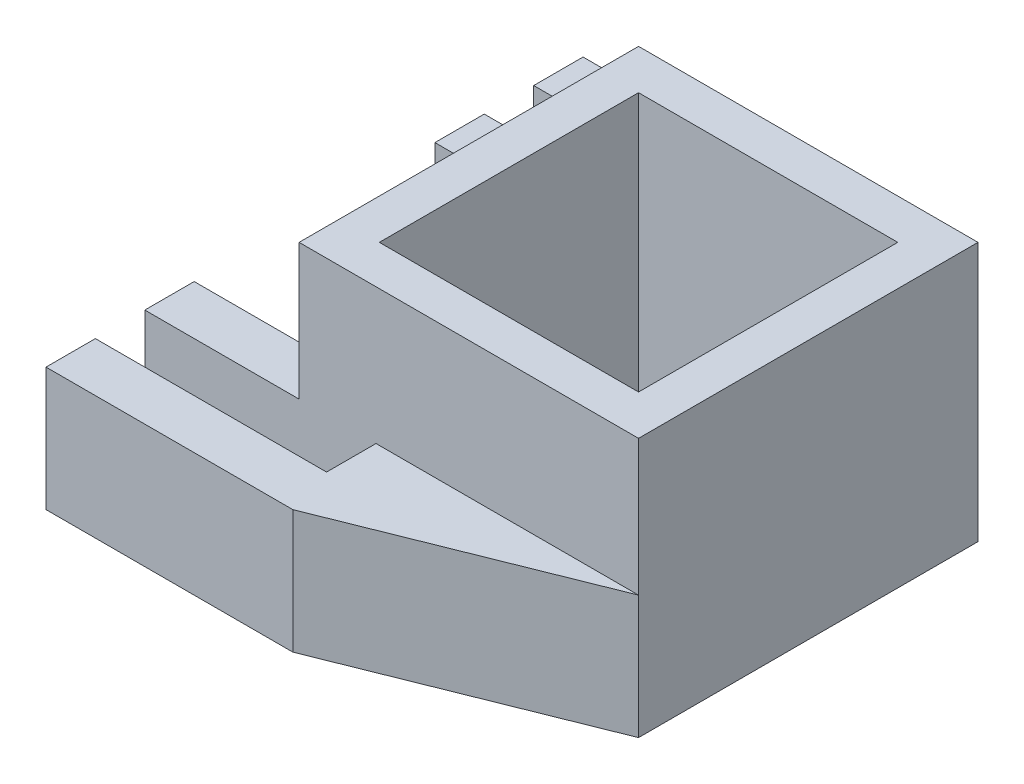
ISO-10303-21;
HEADER;
FILE_DESCRIPTION(('STEP AP214'),'2;1');
FILE_NAME('part.step','',(''),(''),'','','');
FILE_SCHEMA(('AUTOMOTIVE_DESIGN { 1 0 10303 214 1 1 1 1 }'));
ENDSEC;
DATA;
#1=APPLICATION_CONTEXT('core data for automotive mechanical design processes');
#2=APPLICATION_PROTOCOL_DEFINITION('international standard','automotive_design',2000,#1);
#3=PRODUCT_CONTEXT('',#1,'mechanical');
#4=PRODUCT('Part','Part','',(#3));
#5=PRODUCT_RELATED_PRODUCT_CATEGORY('part','',(#4));
#6=PRODUCT_DEFINITION_FORMATION('','',#4);
#7=PRODUCT_DEFINITION_CONTEXT('part definition',#1,'design');
#8=PRODUCT_DEFINITION('design','',#6,#7);
#9=PRODUCT_DEFINITION_SHAPE('','',#8);
#10=(LENGTH_UNIT() NAMED_UNIT(*) SI_UNIT(.MILLI.,.METRE.));
#11=(NAMED_UNIT(*) PLANE_ANGLE_UNIT() SI_UNIT($,.RADIAN.));
#12=(NAMED_UNIT(*) SI_UNIT($,.STERADIAN.) SOLID_ANGLE_UNIT());
#13=UNCERTAINTY_MEASURE_WITH_UNIT(LENGTH_MEASURE(1.E-05),#10,'distance_accuracy_value','');
#14=(GEOMETRIC_REPRESENTATION_CONTEXT(3) GLOBAL_UNCERTAINTY_ASSIGNED_CONTEXT((#13)) GLOBAL_UNIT_ASSIGNED_CONTEXT((#10,
#11,#12)) REPRESENTATION_CONTEXT('',''));
#15=CARTESIAN_POINT('',(0.,0.,0.));
#16=DIRECTION('',(0.,0.,1.));
#17=DIRECTION('',(1.,0.,0.));
#18=AXIS2_PLACEMENT_3D('',#15,#16,#17);
#19=CARTESIAN_POINT('',(-6.5,42.,6.5));
#20=DIRECTION('',(0.,0.,-1.));
#21=DIRECTION('',(-1.,0.,0.));
#22=AXIS2_PLACEMENT_3D('',#19,#20,#21);
#23=PLANE('',#22);
#24=DIRECTION('',(0.,-1.,0.));
#25=VECTOR('',#24,1.);
#26=CARTESIAN_POINT('',(5.96,20.,6.5));
#27=LINE('',#26,#25);
#28=CARTESIAN_POINT('',(5.96,20.,6.5));
#29=VERTEX_POINT('',#28);
#30=CARTESIAN_POINT('',(5.96,0.,6.5));
#31=VERTEX_POINT('',#30);
#32=EDGE_CURVE('E333',#29,#31,#27,.T.);
#33=ORIENTED_EDGE('',*,*,#32,.F.);
#34=DIRECTION('',(1.,0.,0.));
#35=VECTOR('',#34,1.);
#36=CARTESIAN_POINT('',(48.5,20.,6.5));
#37=LINE('',#36,#35);
#38=CARTESIAN_POINT('',(48.5,20.,6.5));
#39=VERTEX_POINT('',#38);
#40=EDGE_CURVE('E300',#29,#39,#37,.T.);
#41=ORIENTED_EDGE('',*,*,#40,.T.);
#42=DIRECTION('',(0.,-1.,0.));
#43=VECTOR('',#42,1.);
#44=CARTESIAN_POINT('',(48.5,42.,6.5));
#45=LINE('',#44,#43);
#46=CARTESIAN_POINT('',(48.5,42.,6.5));
#47=VERTEX_POINT('',#46);
#48=EDGE_CURVE('E41',#47,#39,#45,.T.);
#49=ORIENTED_EDGE('',*,*,#48,.F.);
#50=DIRECTION('',(1.,0.,0.));
#51=VECTOR('',#50,1.);
#52=CARTESIAN_POINT('',(-6.5,42.,6.5));
#53=LINE('',#52,#51);
#54=CARTESIAN_POINT('',(-6.5,42.,6.5));
#55=VERTEX_POINT('',#54);
#56=EDGE_CURVE('E380',#55,#47,#53,.T.);
#57=ORIENTED_EDGE('',*,*,#56,.F.);
#58=DIRECTION('',(0.,-1.,0.));
#59=VECTOR('',#58,1.);
#60=CARTESIAN_POINT('',(-6.5,42.,6.5));
#61=LINE('',#60,#59);
#62=CARTESIAN_POINT('',(-6.5,20.,6.5));
#63=VERTEX_POINT('',#62);
#64=EDGE_CURVE('E11',#55,#63,#61,.T.);
#65=ORIENTED_EDGE('',*,*,#64,.T.);
#66=DIRECTION('',(-1.,0.,0.));
#67=VECTOR('',#66,1.);
#68=CARTESIAN_POINT('',(-6.5,20.,6.5));
#69=LINE('',#68,#67);
#70=CARTESIAN_POINT('',(-31.5,20.,6.5));
#71=VERTEX_POINT('',#70);
#72=EDGE_CURVE('E231',#63,#71,#69,.T.);
#73=ORIENTED_EDGE('',*,*,#72,.T.);
#74=DIRECTION('',(0.,-1.,0.));
#75=VECTOR('',#74,1.);
#76=CARTESIAN_POINT('',(-31.5,20.,6.5));
#77=LINE('',#76,#75);
#78=CARTESIAN_POINT('',(-31.5,0.,6.5));
#79=VERTEX_POINT('',#78);
#80=EDGE_CURVE('E241',#71,#79,#77,.T.);
#81=ORIENTED_EDGE('',*,*,#80,.T.);
#82=DIRECTION('',(1.,0.,0.));
#83=VECTOR('',#82,1.);
#84=CARTESIAN_POINT('',(-6.5,0.,6.5));
#85=LINE('',#84,#83);
#86=EDGE_CURVE('E389',#79,#31,#85,.T.);
#87=ORIENTED_EDGE('',*,*,#86,.T.);
#88=EDGE_LOOP('',(#33,#41,#49,#57,#65,#73,#81,#87));
#89=FACE_BOUND('',#88,.T.);
#90=ADVANCED_FACE('F33',(#89),#23,.F.);
#91=CARTESIAN_POINT('',(0.,42.,0.));
#92=DIRECTION('',(0.,-1.,0.));
#93=DIRECTION('',(0.,0.,-1.));
#94=AXIS2_PLACEMENT_3D('',#91,#92,#93);
#95=PLANE('',#94);
#96=DIRECTION('',(0.,0.,1.));
#97=VECTOR('',#96,1.);
#98=CARTESIAN_POINT('',(-6.5,42.,6.5));
#99=LINE('',#98,#97);
#100=CARTESIAN_POINT('',(-6.5,42.,-48.5));
#101=VERTEX_POINT('',#100);
#102=EDGE_CURVE('E377',#101,#55,#99,.T.);
#103=ORIENTED_EDGE('',*,*,#102,.T.);
#104=ORIENTED_EDGE('',*,*,#56,.T.);
#105=DIRECTION('',(0.,0.,-1.));
#106=VECTOR('',#105,1.);
#107=CARTESIAN_POINT('',(48.5,42.,6.5));
#108=LINE('',#107,#106);
#109=CARTESIAN_POINT('',(48.5,42.,-48.5));
#110=VERTEX_POINT('',#109);
#111=EDGE_CURVE('E383',#47,#110,#108,.T.);
#112=ORIENTED_EDGE('',*,*,#111,.T.);
#113=DIRECTION('',(-1.,0.,0.));
#114=VECTOR('',#113,1.);
#115=CARTESIAN_POINT('',(-6.5,42.,-48.5));
#116=LINE('',#115,#114);
#117=EDGE_CURVE('E385',#110,#101,#116,.T.);
#118=ORIENTED_EDGE('',*,*,#117,.T.);
#119=EDGE_LOOP('',(#103,#104,#112,#118));
#120=FACE_BOUND('',#119,.T.);
#121=DIRECTION('',(0.,0.,1.));
#122=VECTOR('',#121,1.);
#123=CARTESIAN_POINT('',(0.,42.,0.));
#124=LINE('',#123,#122);
#125=CARTESIAN_POINT('',(0.,42.,-42.));
#126=VERTEX_POINT('',#125);
#127=CARTESIAN_POINT('',(0.,42.,0.));
#128=VERTEX_POINT('',#127);
#129=EDGE_CURVE('E346',#126,#128,#124,.T.);
#130=ORIENTED_EDGE('',*,*,#129,.F.);
#131=DIRECTION('',(-1.,0.,0.));
#132=VECTOR('',#131,1.);
#133=CARTESIAN_POINT('',(0.,42.,-42.));
#134=LINE('',#133,#132);
#135=CARTESIAN_POINT('',(42.,42.,-42.));
#136=VERTEX_POINT('',#135);
#137=EDGE_CURVE('E354',#136,#126,#134,.T.);
#138=ORIENTED_EDGE('',*,*,#137,.F.);
#139=DIRECTION('',(0.,0.,-1.));
#140=VECTOR('',#139,1.);
#141=CARTESIAN_POINT('',(42.,42.,0.));
#142=LINE('',#141,#140);
#143=CARTESIAN_POINT('',(42.,42.,0.));
#144=VERTEX_POINT('',#143);
#145=EDGE_CURVE('E351',#144,#136,#142,.T.);
#146=ORIENTED_EDGE('',*,*,#145,.F.);
#147=DIRECTION('',(1.,0.,0.));
#148=VECTOR('',#147,1.);
#149=CARTESIAN_POINT('',(0.,42.,0.));
#150=LINE('',#149,#148);
#151=EDGE_CURVE('E348',#128,#144,#150,.T.);
#152=ORIENTED_EDGE('',*,*,#151,.F.);
#153=EDGE_LOOP('',(#130,#138,#146,#152));
#154=FACE_BOUND('',#153,.T.);
#155=ADVANCED_FACE('F441',(#120,#154),#95,.F.);
#156=CARTESIAN_POINT('',(0.,0.,0.));
#157=DIRECTION('',(0.,-1.,0.));
#158=DIRECTION('',(0.,0.,-1.));
#159=AXIS2_PLACEMENT_3D('',#156,#157,#158);
#160=PLANE('',#159);
#161=DIRECTION('',(0.,0.,1.));
#162=VECTOR('',#161,1.);
#163=CARTESIAN_POINT('',(-6.5,0.,6.5));
#164=LINE('',#163,#162);
#165=CARTESIAN_POINT('',(-6.5,0.,-40.5));
#166=VERTEX_POINT('',#165);
#167=CARTESIAN_POINT('',(-6.5,0.,-1.50000000000001));
#168=VERTEX_POINT('',#167);
#169=EDGE_CURVE('E376',#166,#168,#164,.T.);
#170=ORIENTED_EDGE('',*,*,#169,.F.);
#171=DIRECTION('',(-1.,0.,0.));
#172=VECTOR('',#171,1.);
#173=CARTESIAN_POINT('',(-6.5,0.,-40.5));
#174=LINE('',#173,#172);
#175=CARTESIAN_POINT('',(-31.5,0.,-40.5));
#176=VERTEX_POINT('',#175);
#177=EDGE_CURVE('E224',#166,#176,#174,.T.);
#178=ORIENTED_EDGE('',*,*,#177,.T.);
#179=DIRECTION('',(0.,0.,-1.));
#180=VECTOR('',#179,1.);
#181=CARTESIAN_POINT('',(-31.5,0.,-48.5));
#182=LINE('',#181,#180);
#183=CARTESIAN_POINT('',(-31.5,0.,-48.5));
#184=VERTEX_POINT('',#183);
#185=EDGE_CURVE('E205',#176,#184,#182,.T.);
#186=ORIENTED_EDGE('',*,*,#185,.T.);
#187=DIRECTION('',(-1.,0.,0.));
#188=VECTOR('',#187,1.);
#189=CARTESIAN_POINT('',(-6.5,0.,-48.5));
#190=LINE('',#189,#188);
#191=CARTESIAN_POINT('',(5.96,0.,-48.5));
#192=VERTEX_POINT('',#191);
#193=EDGE_CURVE('E381',#192,#184,#190,.T.);
#194=ORIENTED_EDGE('',*,*,#193,.F.);
#195=DIRECTION('',(0.,0.,-1.));
#196=VECTOR('',#195,1.);
#197=CARTESIAN_POINT('',(5.96,0.,-48.5));
#198=LINE('',#197,#196);
#199=CARTESIAN_POINT('',(5.96,0.,-56.51));
#200=VERTEX_POINT('',#199);
#201=EDGE_CURVE('E276',#192,#200,#198,.T.);
#202=ORIENTED_EDGE('',*,*,#201,.T.);
#203=DIRECTION('',(-1.,0.,0.));
#204=VECTOR('',#203,1.);
#205=CARTESIAN_POINT('',(5.96,0.,-56.51));
#206=LINE('',#205,#204);
#207=CARTESIAN_POINT('',(-31.5,0.,-56.51));
#208=VERTEX_POINT('',#207);
#209=EDGE_CURVE('E279',#200,#208,#206,.T.);
#210=ORIENTED_EDGE('',*,*,#209,.T.);
#211=DIRECTION('',(0.,0.,-1.));
#212=VECTOR('',#211,1.);
#213=CARTESIAN_POINT('',(-31.5,0.,-56.51));
#214=LINE('',#213,#212);
#215=CARTESIAN_POINT('',(-31.5,0.,-64.51));
#216=VERTEX_POINT('',#215);
#217=EDGE_CURVE('E282',#208,#216,#214,.T.);
#218=ORIENTED_EDGE('',*,*,#217,.T.);
#219=DIRECTION('',(1.,0.,0.));
#220=VECTOR('',#219,1.);
#221=CARTESIAN_POINT('',(-31.5,0.,-64.51));
#222=LINE('',#221,#220);
#223=CARTESIAN_POINT('',(8.5,0.,-64.51));
#224=VERTEX_POINT('',#223);
#225=EDGE_CURVE('E258',#216,#224,#222,.T.);
#226=ORIENTED_EDGE('',*,*,#225,.T.);
#227=DIRECTION('',(0.928396635133499,0.,0.371590753212182));
#228=VECTOR('',#227,1.);
#229=CARTESIAN_POINT('',(8.5,0.,-64.51));
#230=LINE('',#229,#228);
#231=CARTESIAN_POINT('',(48.5,0.,-48.5));
#232=VERTEX_POINT('',#231);
#233=EDGE_CURVE('E249',#224,#232,#230,.T.);
#234=ORIENTED_EDGE('',*,*,#233,.T.);
#235=DIRECTION('',(0.,0.,-1.));
#236=VECTOR('',#235,1.);
#237=CARTESIAN_POINT('',(48.5,0.,6.5));
#238=LINE('',#237,#236);
#239=CARTESIAN_POINT('',(48.5,0.,6.5));
#240=VERTEX_POINT('',#239);
#241=EDGE_CURVE('E392',#240,#232,#238,.T.);
#242=ORIENTED_EDGE('',*,*,#241,.F.);
#243=DIRECTION('',(-0.928396635133499,0.,0.371590753212183));
#244=VECTOR('',#243,1.);
#245=CARTESIAN_POINT('',(8.5,0.,22.51));
#246=LINE('',#245,#244);
#247=CARTESIAN_POINT('',(8.5,0.,22.51));
#248=VERTEX_POINT('',#247);
#249=EDGE_CURVE('E289',#240,#248,#246,.T.);
#250=ORIENTED_EDGE('',*,*,#249,.T.);
#251=DIRECTION('',(-1.,0.,0.));
#252=VECTOR('',#251,1.);
#253=CARTESIAN_POINT('',(-31.5,0.,22.51));
#254=LINE('',#253,#252);
#255=CARTESIAN_POINT('',(-31.5,0.,22.51));
#256=VERTEX_POINT('',#255);
#257=EDGE_CURVE('E322',#248,#256,#254,.T.);
#258=ORIENTED_EDGE('',*,*,#257,.T.);
#259=DIRECTION('',(0.,0.,-1.));
#260=VECTOR('',#259,1.);
#261=CARTESIAN_POINT('',(-31.5,0.,14.51));
#262=LINE('',#261,#260);
#263=CARTESIAN_POINT('',(-31.5,0.,14.51));
#264=VERTEX_POINT('',#263);
#265=EDGE_CURVE('E325',#256,#264,#262,.T.);
#266=ORIENTED_EDGE('',*,*,#265,.T.);
#267=DIRECTION('',(1.,0.,0.));
#268=VECTOR('',#267,1.);
#269=CARTESIAN_POINT('',(5.96,0.,14.51));
#270=LINE('',#269,#268);
#271=CARTESIAN_POINT('',(5.96,0.,14.51));
#272=VERTEX_POINT('',#271);
#273=EDGE_CURVE('E328',#264,#272,#270,.T.);
#274=ORIENTED_EDGE('',*,*,#273,.T.);
#275=DIRECTION('',(0.,0.,-1.));
#276=VECTOR('',#275,1.);
#277=CARTESIAN_POINT('',(5.96,0.,6.5));
#278=LINE('',#277,#276);
#279=EDGE_CURVE('E304',#272,#31,#278,.T.);
#280=ORIENTED_EDGE('',*,*,#279,.T.);
#281=ORIENTED_EDGE('',*,*,#86,.F.);
#282=DIRECTION('',(0.,0.,-1.));
#283=VECTOR('',#282,1.);
#284=CARTESIAN_POINT('',(-31.5,0.,6.5));
#285=LINE('',#284,#283);
#286=CARTESIAN_POINT('',(-31.5,0.,-1.50000000000001));
#287=VERTEX_POINT('',#286);
#288=EDGE_CURVE('E227',#79,#287,#285,.T.);
#289=ORIENTED_EDGE('',*,*,#288,.T.);
#290=DIRECTION('',(1.,0.,0.));
#291=VECTOR('',#290,1.);
#292=CARTESIAN_POINT('',(-6.5,0.,-1.5));
#293=LINE('',#292,#291);
#294=EDGE_CURVE('E232',#287,#168,#293,.T.);
#295=ORIENTED_EDGE('',*,*,#294,.T.);
#296=EDGE_LOOP('',(#170,#178,#186,#194,#202,#210,#218,#226,#234,#242,#250,#258,#266,#274,#280,
#281,#289,#295));
#297=FACE_BOUND('',#296,.T.);
#298=DIRECTION('',(-1.,0.,0.));
#299=VECTOR('',#298,1.);
#300=CARTESIAN_POINT('',(0.,0.,-42.));
#301=LINE('',#300,#299);
#302=CARTESIAN_POINT('',(42.,0.,-42.));
#303=VERTEX_POINT('',#302);
#304=CARTESIAN_POINT('',(0.,0.,-42.));
#305=VERTEX_POINT('',#304);
#306=EDGE_CURVE('E349',#303,#305,#301,.T.);
#307=ORIENTED_EDGE('',*,*,#306,.T.);
#308=DIRECTION('',(0.,0.,1.));
#309=VECTOR('',#308,1.);
#310=CARTESIAN_POINT('',(0.,0.,0.));
#311=LINE('',#310,#309);
#312=CARTESIAN_POINT('',(0.,0.,0.));
#313=VERTEX_POINT('',#312);
#314=EDGE_CURVE('E335',#305,#313,#311,.T.);
#315=ORIENTED_EDGE('',*,*,#314,.T.);
#316=DIRECTION('',(1.,0.,0.));
#317=VECTOR('',#316,1.);
#318=CARTESIAN_POINT('',(0.,0.,0.));
#319=LINE('',#318,#317);
#320=CARTESIAN_POINT('',(42.,0.,0.));
#321=VERTEX_POINT('',#320);
#322=EDGE_CURVE('E359',#313,#321,#319,.T.);
#323=ORIENTED_EDGE('',*,*,#322,.T.);
#324=DIRECTION('',(0.,0.,-1.));
#325=VECTOR('',#324,1.);
#326=CARTESIAN_POINT('',(42.,0.,0.));
#327=LINE('',#326,#325);
#328=EDGE_CURVE('E362',#321,#303,#327,.T.);
#329=ORIENTED_EDGE('',*,*,#328,.T.);
#330=EDGE_LOOP('',(#307,#315,#323,#329));
#331=FACE_BOUND('',#330,.T.);
#332=ADVANCED_FACE('F430',(#297,#331),#160,.T.);
#333=CARTESIAN_POINT('',(-6.5,42.,6.5));
#334=DIRECTION('',(1.,0.,0.));
#335=DIRECTION('',(0.,0.,-1.));
#336=AXIS2_PLACEMENT_3D('',#333,#334,#335);
#337=PLANE('',#336);
#338=DIRECTION('',(0.,0.,1.));
#339=VECTOR('',#338,1.);
#340=CARTESIAN_POINT('',(-6.5,20.,-48.5));
#341=LINE('',#340,#339);
#342=CARTESIAN_POINT('',(-6.5,20.,-48.5));
#343=VERTEX_POINT('',#342);
#344=CARTESIAN_POINT('',(-6.5,20.,-40.5));
#345=VERTEX_POINT('',#344);
#346=EDGE_CURVE('E48',#343,#345,#341,.T.);
#347=ORIENTED_EDGE('',*,*,#346,.T.);
#348=DIRECTION('',(0.,-1.,0.));
#349=VECTOR('',#348,1.);
#350=CARTESIAN_POINT('',(-6.5,20.,-40.5));
#351=LINE('',#350,#349);
#352=EDGE_CURVE('E52',#345,#166,#351,.T.);
#353=ORIENTED_EDGE('',*,*,#352,.T.);
#354=ORIENTED_EDGE('',*,*,#169,.T.);
#355=DIRECTION('',(0.,-1.,0.));
#356=VECTOR('',#355,1.);
#357=CARTESIAN_POINT('',(-6.5,20.,-1.5));
#358=LINE('',#357,#356);
#359=CARTESIAN_POINT('',(-6.5,20.,-1.50000000000001));
#360=VERTEX_POINT('',#359);
#361=EDGE_CURVE('E246',#360,#168,#358,.T.);
#362=ORIENTED_EDGE('',*,*,#361,.F.);
#363=DIRECTION('',(0.,0.,1.));
#364=VECTOR('',#363,1.);
#365=CARTESIAN_POINT('',(-6.5,20.,6.5));
#366=LINE('',#365,#364);
#367=EDGE_CURVE('E229',#360,#63,#366,.T.);
#368=ORIENTED_EDGE('',*,*,#367,.T.);
#369=ORIENTED_EDGE('',*,*,#64,.F.);
#370=ORIENTED_EDGE('',*,*,#102,.F.);
#371=DIRECTION('',(0.,-1.,0.));
#372=VECTOR('',#371,1.);
#373=CARTESIAN_POINT('',(-6.5,42.,-48.5));
#374=LINE('',#373,#372);
#375=EDGE_CURVE('E387',#101,#343,#374,.T.);
#376=ORIENTED_EDGE('',*,*,#375,.T.);
#377=EDGE_LOOP('',(#347,#353,#354,#362,#368,#369,#370,#376));
#378=FACE_BOUND('',#377,.T.);
#379=ADVANCED_FACE('F35',(#378),#337,.F.);
#380=CARTESIAN_POINT('',(48.5,42.,6.5));
#381=DIRECTION('',(-1.,0.,0.));
#382=DIRECTION('',(0.,0.,1.));
#383=AXIS2_PLACEMENT_3D('',#380,#381,#382);
#384=PLANE('',#383);
#385=ORIENTED_EDGE('',*,*,#241,.T.);
#386=DIRECTION('',(0.,-1.,0.));
#387=VECTOR('',#386,1.);
#388=CARTESIAN_POINT('',(48.5,20.,-48.5));
#389=LINE('',#388,#387);
#390=CARTESIAN_POINT('',(48.5,20.,-48.5));
#391=VERTEX_POINT('',#390);
#392=EDGE_CURVE('E273',#391,#232,#389,.T.);
#393=ORIENTED_EDGE('',*,*,#392,.F.);
#394=DIRECTION('',(0.,-1.,0.));
#395=VECTOR('',#394,1.);
#396=CARTESIAN_POINT('',(48.5,42.,-48.5));
#397=LINE('',#396,#395);
#398=EDGE_CURVE('E397',#110,#391,#397,.T.);
#399=ORIENTED_EDGE('',*,*,#398,.F.);
#400=ORIENTED_EDGE('',*,*,#111,.F.);
#401=ORIENTED_EDGE('',*,*,#48,.T.);
#402=DIRECTION('',(0.,-1.,0.));
#403=VECTOR('',#402,1.);
#404=CARTESIAN_POINT('',(48.5,20.,6.5));
#405=LINE('',#404,#403);
#406=EDGE_CURVE('E319',#39,#240,#405,.T.);
#407=ORIENTED_EDGE('',*,*,#406,.T.);
#408=EDGE_LOOP('',(#385,#393,#399,#400,#401,#407));
#409=FACE_BOUND('',#408,.T.);
#410=ADVANCED_FACE('F403',(#409),#384,.F.);
#411=CARTESIAN_POINT('',(-6.5,42.,-48.5));
#412=DIRECTION('',(0.,0.,1.));
#413=DIRECTION('',(1.,0.,0.));
#414=AXIS2_PLACEMENT_3D('',#411,#412,#413);
#415=PLANE('',#414);
#416=ORIENTED_EDGE('',*,*,#398,.T.);
#417=DIRECTION('',(-1.,0.,0.));
#418=VECTOR('',#417,1.);
#419=CARTESIAN_POINT('',(48.5,20.,-48.5));
#420=LINE('',#419,#418);
#421=CARTESIAN_POINT('',(5.96,20.,-48.5));
#422=VERTEX_POINT('',#421);
#423=EDGE_CURVE('E257',#391,#422,#420,.T.);
#424=ORIENTED_EDGE('',*,*,#423,.T.);
#425=DIRECTION('',(0.,-1.,0.));
#426=VECTOR('',#425,1.);
#427=CARTESIAN_POINT('',(5.96,20.,-48.5));
#428=LINE('',#427,#426);
#429=EDGE_CURVE('E296',#422,#192,#428,.T.);
#430=ORIENTED_EDGE('',*,*,#429,.T.);
#431=ORIENTED_EDGE('',*,*,#193,.T.);
#432=DIRECTION('',(0.,-1.,0.));
#433=VECTOR('',#432,1.);
#434=CARTESIAN_POINT('',(-31.5,20.,-48.5));
#435=LINE('',#434,#433);
#436=CARTESIAN_POINT('',(-31.5,20.,-48.5));
#437=VERTEX_POINT('',#436);
#438=EDGE_CURVE('E209',#437,#184,#435,.T.);
#439=ORIENTED_EDGE('',*,*,#438,.F.);
#440=DIRECTION('',(1.,0.,0.));
#441=VECTOR('',#440,1.);
#442=CARTESIAN_POINT('',(-6.5,20.,-48.5));
#443=LINE('',#442,#441);
#444=EDGE_CURVE('E219',#437,#343,#443,.T.);
#445=ORIENTED_EDGE('',*,*,#444,.T.);
#446=ORIENTED_EDGE('',*,*,#375,.F.);
#447=ORIENTED_EDGE('',*,*,#117,.F.);
#448=EDGE_LOOP('',(#416,#424,#430,#431,#439,#445,#446,#447));
#449=FACE_BOUND('',#448,.T.);
#450=ADVANCED_FACE('F437',(#449),#415,.F.);
#451=CARTESIAN_POINT('',(0.,42.,0.));
#452=DIRECTION('',(1.,0.,0.));
#453=DIRECTION('',(0.,0.,-1.));
#454=AXIS2_PLACEMENT_3D('',#451,#452,#453);
#455=PLANE('',#454);
#456=ORIENTED_EDGE('',*,*,#314,.F.);
#457=DIRECTION('',(0.,-1.,0.));
#458=VECTOR('',#457,1.);
#459=CARTESIAN_POINT('',(0.,42.,-42.));
#460=LINE('',#459,#458);
#461=EDGE_CURVE('E356',#126,#305,#460,.T.);
#462=ORIENTED_EDGE('',*,*,#461,.F.);
#463=ORIENTED_EDGE('',*,*,#129,.T.);
#464=DIRECTION('',(0.,-1.,0.));
#465=VECTOR('',#464,1.);
#466=CARTESIAN_POINT('',(0.,42.,0.));
#467=LINE('',#466,#465);
#468=EDGE_CURVE('E373',#128,#313,#467,.T.);
#469=ORIENTED_EDGE('',*,*,#468,.T.);
#470=EDGE_LOOP('',(#456,#462,#463,#469));
#471=FACE_BOUND('',#470,.T.);
#472=ADVANCED_FACE('F495',(#471),#455,.T.);
#473=CARTESIAN_POINT('',(0.,42.,0.));
#474=DIRECTION('',(0.,0.,-1.));
#475=DIRECTION('',(-1.,0.,0.));
#476=AXIS2_PLACEMENT_3D('',#473,#474,#475);
#477=PLANE('',#476);
#478=ORIENTED_EDGE('',*,*,#322,.F.);
#479=ORIENTED_EDGE('',*,*,#468,.F.);
#480=ORIENTED_EDGE('',*,*,#151,.T.);
#481=DIRECTION('',(0.,-1.,0.));
#482=VECTOR('',#481,1.);
#483=CARTESIAN_POINT('',(42.,42.,0.));
#484=LINE('',#483,#482);
#485=EDGE_CURVE('E371',#144,#321,#484,.T.);
#486=ORIENTED_EDGE('',*,*,#485,.T.);
#487=EDGE_LOOP('',(#478,#479,#480,#486));
#488=FACE_BOUND('',#487,.T.);
#489=ADVANCED_FACE('F500',(#488),#477,.T.);
#490=CARTESIAN_POINT('',(42.,42.,0.));
#491=DIRECTION('',(-1.,0.,0.));
#492=DIRECTION('',(0.,0.,1.));
#493=AXIS2_PLACEMENT_3D('',#490,#491,#492);
#494=PLANE('',#493);
#495=ORIENTED_EDGE('',*,*,#328,.F.);
#496=ORIENTED_EDGE('',*,*,#485,.F.);
#497=ORIENTED_EDGE('',*,*,#145,.T.);
#498=DIRECTION('',(0.,-1.,0.));
#499=VECTOR('',#498,1.);
#500=CARTESIAN_POINT('',(42.,42.,-42.));
#501=LINE('',#500,#499);
#502=EDGE_CURVE('E369',#136,#303,#501,.T.);
#503=ORIENTED_EDGE('',*,*,#502,.T.);
#504=EDGE_LOOP('',(#495,#496,#497,#503));
#505=FACE_BOUND('',#504,.T.);
#506=ADVANCED_FACE('F504',(#505),#494,.T.);
#507=CARTESIAN_POINT('',(0.,42.,-42.));
#508=DIRECTION('',(0.,0.,1.));
#509=DIRECTION('',(1.,0.,0.));
#510=AXIS2_PLACEMENT_3D('',#507,#508,#509);
#511=PLANE('',#510);
#512=ORIENTED_EDGE('',*,*,#306,.F.);
#513=ORIENTED_EDGE('',*,*,#502,.F.);
#514=ORIENTED_EDGE('',*,*,#137,.T.);
#515=ORIENTED_EDGE('',*,*,#461,.T.);
#516=EDGE_LOOP('',(#512,#513,#514,#515));
#517=FACE_BOUND('',#516,.T.);
#518=ADVANCED_FACE('F508',(#517),#511,.T.);
#519=CARTESIAN_POINT('',(5.96,20.,6.5));
#520=DIRECTION('',(-1.,0.,0.));
#521=DIRECTION('',(0.,0.,1.));
#522=AXIS2_PLACEMENT_3D('',#519,#520,#521);
#523=PLANE('',#522);
#524=ORIENTED_EDGE('',*,*,#279,.F.);
#525=DIRECTION('',(0.,-1.,0.));
#526=VECTOR('',#525,1.);
#527=CARTESIAN_POINT('',(5.96,20.,14.51));
#528=LINE('',#527,#526);
#529=CARTESIAN_POINT('',(5.96,20.,14.51));
#530=VERTEX_POINT('',#529);
#531=EDGE_CURVE('E336',#530,#272,#528,.T.);
#532=ORIENTED_EDGE('',*,*,#531,.F.);
#533=DIRECTION('',(0.,0.,-1.));
#534=VECTOR('',#533,1.);
#535=CARTESIAN_POINT('',(5.96,20.,6.5));
#536=LINE('',#535,#534);
#537=EDGE_CURVE('E316',#530,#29,#536,.T.);
#538=ORIENTED_EDGE('',*,*,#537,.T.);
#539=ORIENTED_EDGE('',*,*,#32,.T.);
#540=EDGE_LOOP('',(#524,#532,#538,#539));
#541=FACE_BOUND('',#540,.T.);
#542=ADVANCED_FACE('F416',(#541),#523,.T.);
#543=CARTESIAN_POINT('',(5.96,20.,14.51));
#544=DIRECTION('',(0.,0.,-1.));
#545=DIRECTION('',(-1.,0.,0.));
#546=AXIS2_PLACEMENT_3D('',#543,#544,#545);
#547=PLANE('',#546);
#548=ORIENTED_EDGE('',*,*,#273,.F.);
#549=DIRECTION('',(0.,-1.,0.));
#550=VECTOR('',#549,1.);
#551=CARTESIAN_POINT('',(-31.5,20.,14.51));
#552=LINE('',#551,#550);
#553=CARTESIAN_POINT('',(-31.5,20.,14.51));
#554=VERTEX_POINT('',#553);
#555=EDGE_CURVE('E338',#554,#264,#552,.T.);
#556=ORIENTED_EDGE('',*,*,#555,.F.);
#557=DIRECTION('',(1.,0.,0.));
#558=VECTOR('',#557,1.);
#559=CARTESIAN_POINT('',(5.96,20.,14.51));
#560=LINE('',#559,#558);
#561=EDGE_CURVE('E313',#554,#530,#560,.T.);
#562=ORIENTED_EDGE('',*,*,#561,.T.);
#563=ORIENTED_EDGE('',*,*,#531,.T.);
#564=EDGE_LOOP('',(#548,#556,#562,#563));
#565=FACE_BOUND('',#564,.T.);
#566=ADVANCED_FACE('F419',(#565),#547,.T.);
#567=CARTESIAN_POINT('',(-31.5,20.,14.51));
#568=DIRECTION('',(-1.,0.,0.));
#569=DIRECTION('',(0.,0.,1.));
#570=AXIS2_PLACEMENT_3D('',#567,#568,#569);
#571=PLANE('',#570);
#572=ORIENTED_EDGE('',*,*,#265,.F.);
#573=DIRECTION('',(0.,-1.,0.));
#574=VECTOR('',#573,1.);
#575=CARTESIAN_POINT('',(-31.5,20.,22.51));
#576=LINE('',#575,#574);
#577=CARTESIAN_POINT('',(-31.5,20.,22.51));
#578=VERTEX_POINT('',#577);
#579=EDGE_CURVE('E340',#578,#256,#576,.T.);
#580=ORIENTED_EDGE('',*,*,#579,.F.);
#581=DIRECTION('',(0.,0.,-1.));
#582=VECTOR('',#581,1.);
#583=CARTESIAN_POINT('',(-31.5,20.,14.51));
#584=LINE('',#583,#582);
#585=EDGE_CURVE('E310',#578,#554,#584,.T.);
#586=ORIENTED_EDGE('',*,*,#585,.T.);
#587=ORIENTED_EDGE('',*,*,#555,.T.);
#588=EDGE_LOOP('',(#572,#580,#586,#587));
#589=FACE_BOUND('',#588,.T.);
#590=ADVANCED_FACE('F423',(#589),#571,.T.);
#591=CARTESIAN_POINT('',(-31.5,20.,22.51));
#592=DIRECTION('',(0.,0.,1.));
#593=DIRECTION('',(1.,0.,0.));
#594=AXIS2_PLACEMENT_3D('',#591,#592,#593);
#595=PLANE('',#594);
#596=ORIENTED_EDGE('',*,*,#257,.F.);
#597=DIRECTION('',(0.,-1.,0.));
#598=VECTOR('',#597,1.);
#599=CARTESIAN_POINT('',(8.5,20.,22.51));
#600=LINE('',#599,#598);
#601=CARTESIAN_POINT('',(8.5,20.,22.51));
#602=VERTEX_POINT('',#601);
#603=EDGE_CURVE('E342',#602,#248,#600,.T.);
#604=ORIENTED_EDGE('',*,*,#603,.F.);
#605=DIRECTION('',(-1.,0.,0.));
#606=VECTOR('',#605,1.);
#607=CARTESIAN_POINT('',(-31.5,20.,22.51));
#608=LINE('',#607,#606);
#609=EDGE_CURVE('E307',#602,#578,#608,.T.);
#610=ORIENTED_EDGE('',*,*,#609,.T.);
#611=ORIENTED_EDGE('',*,*,#579,.T.);
#612=EDGE_LOOP('',(#596,#604,#610,#611));
#613=FACE_BOUND('',#612,.T.);
#614=ADVANCED_FACE('F426',(#613),#595,.T.);
#615=CARTESIAN_POINT('',(8.5,20.,22.51));
#616=DIRECTION('',(0.371590753212183,0.,0.928396635133499));
#617=DIRECTION('',(0.928396635133499,0.,-0.371590753212183));
#618=AXIS2_PLACEMENT_3D('',#615,#616,#617);
#619=PLANE('',#618);
#620=ORIENTED_EDGE('',*,*,#249,.F.);
#621=ORIENTED_EDGE('',*,*,#406,.F.);
#622=DIRECTION('',(-0.928396635133499,0.,0.371590753212183));
#623=VECTOR('',#622,1.);
#624=CARTESIAN_POINT('',(8.5,20.,22.51));
#625=LINE('',#624,#623);
#626=EDGE_CURVE('E303',#39,#602,#625,.T.);
#627=ORIENTED_EDGE('',*,*,#626,.T.);
#628=ORIENTED_EDGE('',*,*,#603,.T.);
#629=EDGE_LOOP('',(#620,#621,#627,#628));
#630=FACE_BOUND('',#629,.T.);
#631=ADVANCED_FACE('F428',(#630),#619,.T.);
#632=CARTESIAN_POINT('',(0.,20.,0.));
#633=DIRECTION('',(0.,1.,0.));
#634=DIRECTION('',(0.,0.,1.));
#635=AXIS2_PLACEMENT_3D('',#632,#633,#634);
#636=PLANE('',#635);
#637=ORIENTED_EDGE('',*,*,#40,.F.);
#638=ORIENTED_EDGE('',*,*,#537,.F.);
#639=ORIENTED_EDGE('',*,*,#561,.F.);
#640=ORIENTED_EDGE('',*,*,#585,.F.);
#641=ORIENTED_EDGE('',*,*,#609,.F.);
#642=ORIENTED_EDGE('',*,*,#626,.F.);
#643=EDGE_LOOP('',(#637,#638,#639,#640,#641,#642));
#644=FACE_BOUND('',#643,.T.);
#645=ADVANCED_FACE('F411',(#644),#636,.T.);
#646=CARTESIAN_POINT('',(8.5,20.,-64.51));
#647=DIRECTION('',(0.371590753212182,0.,-0.928396635133499));
#648=DIRECTION('',(-0.928396635133499,0.,-0.371590753212182));
#649=AXIS2_PLACEMENT_3D('',#646,#647,#648);
#650=PLANE('',#649);
#651=ORIENTED_EDGE('',*,*,#233,.F.);
#652=DIRECTION('',(0.,-1.,0.));
#653=VECTOR('',#652,1.);
#654=CARTESIAN_POINT('',(8.5,20.,-64.51));
#655=LINE('',#654,#653);
#656=CARTESIAN_POINT('',(8.5,20.,-64.51));
#657=VERTEX_POINT('',#656);
#658=EDGE_CURVE('E287',#657,#224,#655,.T.);
#659=ORIENTED_EDGE('',*,*,#658,.F.);
#660=DIRECTION('',(0.928396635133499,0.,0.371590753212182));
#661=VECTOR('',#660,1.);
#662=CARTESIAN_POINT('',(8.5,20.,-64.51));
#663=LINE('',#662,#661);
#664=EDGE_CURVE('E254',#657,#391,#663,.T.);
#665=ORIENTED_EDGE('',*,*,#664,.T.);
#666=ORIENTED_EDGE('',*,*,#392,.T.);
#667=EDGE_LOOP('',(#651,#659,#665,#666));
#668=FACE_BOUND('',#667,.T.);
#669=ADVANCED_FACE('F474',(#668),#650,.T.);
#670=CARTESIAN_POINT('',(-31.5,20.,-64.51));
#671=DIRECTION('',(0.,0.,-1.));
#672=DIRECTION('',(-1.,0.,0.));
#673=AXIS2_PLACEMENT_3D('',#670,#671,#672);
#674=PLANE('',#673);
#675=ORIENTED_EDGE('',*,*,#225,.F.);
#676=DIRECTION('',(0.,-1.,0.));
#677=VECTOR('',#676,1.);
#678=CARTESIAN_POINT('',(-31.5,20.,-64.51));
#679=LINE('',#678,#677);
#680=CARTESIAN_POINT('',(-31.5,20.,-64.51));
#681=VERTEX_POINT('',#680);
#682=EDGE_CURVE('E290',#681,#216,#679,.T.);
#683=ORIENTED_EDGE('',*,*,#682,.F.);
#684=DIRECTION('',(1.,0.,0.));
#685=VECTOR('',#684,1.);
#686=CARTESIAN_POINT('',(-31.5,20.,-64.51));
#687=LINE('',#686,#685);
#688=EDGE_CURVE('E270',#681,#657,#687,.T.);
#689=ORIENTED_EDGE('',*,*,#688,.T.);
#690=ORIENTED_EDGE('',*,*,#658,.T.);
#691=EDGE_LOOP('',(#675,#683,#689,#690));
#692=FACE_BOUND('',#691,.T.);
#693=ADVANCED_FACE('F473',(#692),#674,.T.);
#694=CARTESIAN_POINT('',(-31.5,20.,-56.51));
#695=DIRECTION('',(-1.,0.,0.));
#696=DIRECTION('',(0.,0.,1.));
#697=AXIS2_PLACEMENT_3D('',#694,#695,#696);
#698=PLANE('',#697);
#699=ORIENTED_EDGE('',*,*,#217,.F.);
#700=DIRECTION('',(0.,-1.,0.));
#701=VECTOR('',#700,1.);
#702=CARTESIAN_POINT('',(-31.5,20.,-56.51));
#703=LINE('',#702,#701);
#704=CARTESIAN_POINT('',(-31.5,20.,-56.51));
#705=VERTEX_POINT('',#704);
#706=EDGE_CURVE('E292',#705,#208,#703,.T.);
#707=ORIENTED_EDGE('',*,*,#706,.F.);
#708=DIRECTION('',(0.,0.,-1.));
#709=VECTOR('',#708,1.);
#710=CARTESIAN_POINT('',(-31.5,20.,-56.51));
#711=LINE('',#710,#709);
#712=EDGE_CURVE('E267',#705,#681,#711,.T.);
#713=ORIENTED_EDGE('',*,*,#712,.T.);
#714=ORIENTED_EDGE('',*,*,#682,.T.);
#715=EDGE_LOOP('',(#699,#707,#713,#714));
#716=FACE_BOUND('',#715,.T.);
#717=ADVANCED_FACE('F481',(#716),#698,.T.);
#718=CARTESIAN_POINT('',(5.96,20.,-56.51));
#719=DIRECTION('',(0.,0.,1.));
#720=DIRECTION('',(1.,0.,0.));
#721=AXIS2_PLACEMENT_3D('',#718,#719,#720);
#722=PLANE('',#721);
#723=ORIENTED_EDGE('',*,*,#209,.F.);
#724=DIRECTION('',(0.,-1.,0.));
#725=VECTOR('',#724,1.);
#726=CARTESIAN_POINT('',(5.96,20.,-56.51));
#727=LINE('',#726,#725);
#728=CARTESIAN_POINT('',(5.96,20.,-56.51));
#729=VERTEX_POINT('',#728);
#730=EDGE_CURVE('E294',#729,#200,#727,.T.);
#731=ORIENTED_EDGE('',*,*,#730,.F.);
#732=DIRECTION('',(-1.,0.,0.));
#733=VECTOR('',#732,1.);
#734=CARTESIAN_POINT('',(5.96,20.,-56.51));
#735=LINE('',#734,#733);
#736=EDGE_CURVE('E264',#729,#705,#735,.T.);
#737=ORIENTED_EDGE('',*,*,#736,.T.);
#738=ORIENTED_EDGE('',*,*,#706,.T.);
#739=EDGE_LOOP('',(#723,#731,#737,#738));
#740=FACE_BOUND('',#739,.T.);
#741=ADVANCED_FACE('F468',(#740),#722,.T.);
#742=CARTESIAN_POINT('',(5.96,20.,-48.5));
#743=DIRECTION('',(-1.,0.,0.));
#744=DIRECTION('',(0.,0.,1.));
#745=AXIS2_PLACEMENT_3D('',#742,#743,#744);
#746=PLANE('',#745);
#747=ORIENTED_EDGE('',*,*,#201,.F.);
#748=ORIENTED_EDGE('',*,*,#429,.F.);
#749=DIRECTION('',(0.,0.,-1.));
#750=VECTOR('',#749,1.);
#751=CARTESIAN_POINT('',(5.96,20.,-48.5));
#752=LINE('',#751,#750);
#753=EDGE_CURVE('E261',#422,#729,#752,.T.);
#754=ORIENTED_EDGE('',*,*,#753,.T.);
#755=ORIENTED_EDGE('',*,*,#730,.T.);
#756=EDGE_LOOP('',(#747,#748,#754,#755));
#757=FACE_BOUND('',#756,.T.);
#758=ADVANCED_FACE('F459',(#757),#746,.T.);
#759=CARTESIAN_POINT('',(0.,20.,0.));
#760=DIRECTION('',(0.,1.,0.));
#761=DIRECTION('',(0.,0.,1.));
#762=AXIS2_PLACEMENT_3D('',#759,#760,#761);
#763=PLANE('',#762);
#764=ORIENTED_EDGE('',*,*,#664,.F.);
#765=ORIENTED_EDGE('',*,*,#688,.F.);
#766=ORIENTED_EDGE('',*,*,#712,.F.);
#767=ORIENTED_EDGE('',*,*,#736,.F.);
#768=ORIENTED_EDGE('',*,*,#753,.F.);
#769=ORIENTED_EDGE('',*,*,#423,.F.);
#770=EDGE_LOOP('',(#764,#765,#766,#767,#768,#769));
#771=FACE_BOUND('',#770,.T.);
#772=ADVANCED_FACE('F463',(#771),#763,.T.);
#773=CARTESIAN_POINT('',(-6.5,20.,-1.5));
#774=DIRECTION('',(0.,0.,-1.));
#775=DIRECTION('',(-1.,0.,0.));
#776=AXIS2_PLACEMENT_3D('',#773,#774,#775);
#777=PLANE('',#776);
#778=ORIENTED_EDGE('',*,*,#294,.F.);
#779=DIRECTION('',(0.,-1.,0.));
#780=VECTOR('',#779,1.);
#781=CARTESIAN_POINT('',(-31.5,20.,-1.50000000000001));
#782=LINE('',#781,#780);
#783=CARTESIAN_POINT('',(-31.5,20.,-1.50000000000001));
#784=VERTEX_POINT('',#783);
#785=EDGE_CURVE('E250',#784,#287,#782,.T.);
#786=ORIENTED_EDGE('',*,*,#785,.F.);
#787=DIRECTION('',(1.,0.,0.));
#788=VECTOR('',#787,1.);
#789=CARTESIAN_POINT('',(-6.5,20.,-1.5));
#790=LINE('',#789,#788);
#791=EDGE_CURVE('E238',#784,#360,#790,.T.);
#792=ORIENTED_EDGE('',*,*,#791,.T.);
#793=ORIENTED_EDGE('',*,*,#361,.T.);
#794=EDGE_LOOP('',(#778,#786,#792,#793));
#795=FACE_BOUND('',#794,.T.);
#796=ADVANCED_FACE('F455',(#795),#777,.T.);
#797=CARTESIAN_POINT('',(-31.5,20.,6.5));
#798=DIRECTION('',(-1.,0.,0.));
#799=DIRECTION('',(0.,0.,1.));
#800=AXIS2_PLACEMENT_3D('',#797,#798,#799);
#801=PLANE('',#800);
#802=ORIENTED_EDGE('',*,*,#288,.F.);
#803=ORIENTED_EDGE('',*,*,#80,.F.);
#804=DIRECTION('',(0.,0.,-1.));
#805=VECTOR('',#804,1.);
#806=CARTESIAN_POINT('',(-31.5,20.,6.5));
#807=LINE('',#806,#805);
#808=EDGE_CURVE('E235',#71,#784,#807,.T.);
#809=ORIENTED_EDGE('',*,*,#808,.T.);
#810=ORIENTED_EDGE('',*,*,#785,.T.);
#811=EDGE_LOOP('',(#802,#803,#809,#810));
#812=FACE_BOUND('',#811,.T.);
#813=ADVANCED_FACE('F452',(#812),#801,.T.);
#814=CARTESIAN_POINT('',(0.,20.,0.));
#815=DIRECTION('',(0.,1.,0.));
#816=DIRECTION('',(0.,0.,1.));
#817=AXIS2_PLACEMENT_3D('',#814,#815,#816);
#818=PLANE('',#817);
#819=ORIENTED_EDGE('',*,*,#367,.F.);
#820=ORIENTED_EDGE('',*,*,#791,.F.);
#821=ORIENTED_EDGE('',*,*,#808,.F.);
#822=ORIENTED_EDGE('',*,*,#72,.F.);
#823=EDGE_LOOP('',(#819,#820,#821,#822));
#824=FACE_BOUND('',#823,.T.);
#825=ADVANCED_FACE('F448',(#824),#818,.T.);
#826=CARTESIAN_POINT('',(-31.5,20.,-48.5));
#827=DIRECTION('',(-1.,0.,0.));
#828=DIRECTION('',(0.,0.,1.));
#829=AXIS2_PLACEMENT_3D('',#826,#827,#828);
#830=PLANE('',#829);
#831=ORIENTED_EDGE('',*,*,#185,.F.);
#832=DIRECTION('',(0.,-1.,0.));
#833=VECTOR('',#832,1.);
#834=CARTESIAN_POINT('',(-31.5,20.,-40.5));
#835=LINE('',#834,#833);
#836=CARTESIAN_POINT('',(-31.5,20.,-40.5));
#837=VERTEX_POINT('',#836);
#838=EDGE_CURVE('E198',#837,#176,#835,.T.);
#839=ORIENTED_EDGE('',*,*,#838,.F.);
#840=DIRECTION('',(0.,0.,-1.));
#841=VECTOR('',#840,1.);
#842=CARTESIAN_POINT('',(-31.5,20.,-48.5));
#843=LINE('',#842,#841);
#844=EDGE_CURVE('E203',#837,#437,#843,.T.);
#845=ORIENTED_EDGE('',*,*,#844,.T.);
#846=ORIENTED_EDGE('',*,*,#438,.T.);
#847=EDGE_LOOP('',(#831,#839,#845,#846));
#848=FACE_BOUND('',#847,.T.);
#849=ADVANCED_FACE('F200',(#848),#830,.T.);
#850=CARTESIAN_POINT('',(-6.5,20.,-40.5));
#851=DIRECTION('',(0.,0.,1.));
#852=DIRECTION('',(1.,0.,0.));
#853=AXIS2_PLACEMENT_3D('',#850,#851,#852);
#854=PLANE('',#853);
#855=ORIENTED_EDGE('',*,*,#177,.F.);
#856=ORIENTED_EDGE('',*,*,#352,.F.);
#857=DIRECTION('',(-1.,0.,0.));
#858=VECTOR('',#857,1.);
#859=CARTESIAN_POINT('',(-6.5,20.,-40.5));
#860=LINE('',#859,#858);
#861=EDGE_CURVE('E212',#345,#837,#860,.T.);
#862=ORIENTED_EDGE('',*,*,#861,.T.);
#863=ORIENTED_EDGE('',*,*,#838,.T.);
#864=EDGE_LOOP('',(#855,#856,#862,#863));
#865=FACE_BOUND('',#864,.T.);
#866=ADVANCED_FACE('F213',(#865),#854,.T.);
#867=CARTESIAN_POINT('',(0.,20.,0.));
#868=DIRECTION('',(0.,1.,0.));
#869=DIRECTION('',(0.,0.,1.));
#870=AXIS2_PLACEMENT_3D('',#867,#868,#869);
#871=PLANE('',#870);
#872=ORIENTED_EDGE('',*,*,#444,.F.);
#873=ORIENTED_EDGE('',*,*,#844,.F.);
#874=ORIENTED_EDGE('',*,*,#861,.F.);
#875=ORIENTED_EDGE('',*,*,#346,.F.);
#876=EDGE_LOOP('',(#872,#873,#874,#875));
#877=FACE_BOUND('',#876,.T.);
#878=ADVANCED_FACE('F217',(#877),#871,.T.);
#879=CLOSED_SHELL('',(#90,#155,#332,#379,#410,#450,#472,#489,#506,#518,#542,#566,#590,#614,#631,
#645,#669,#693,#717,#741,#758,#772,#796,#813,#825,#849,#866,#878));
#880=MANIFOLD_SOLID_BREP('B2',#879);
#881=ADVANCED_BREP_SHAPE_REPRESENTATION('',(#18,#880),#14);
#882=SHAPE_DEFINITION_REPRESENTATION(#9,#881);
ENDSEC;
END-ISO-10303-21;
